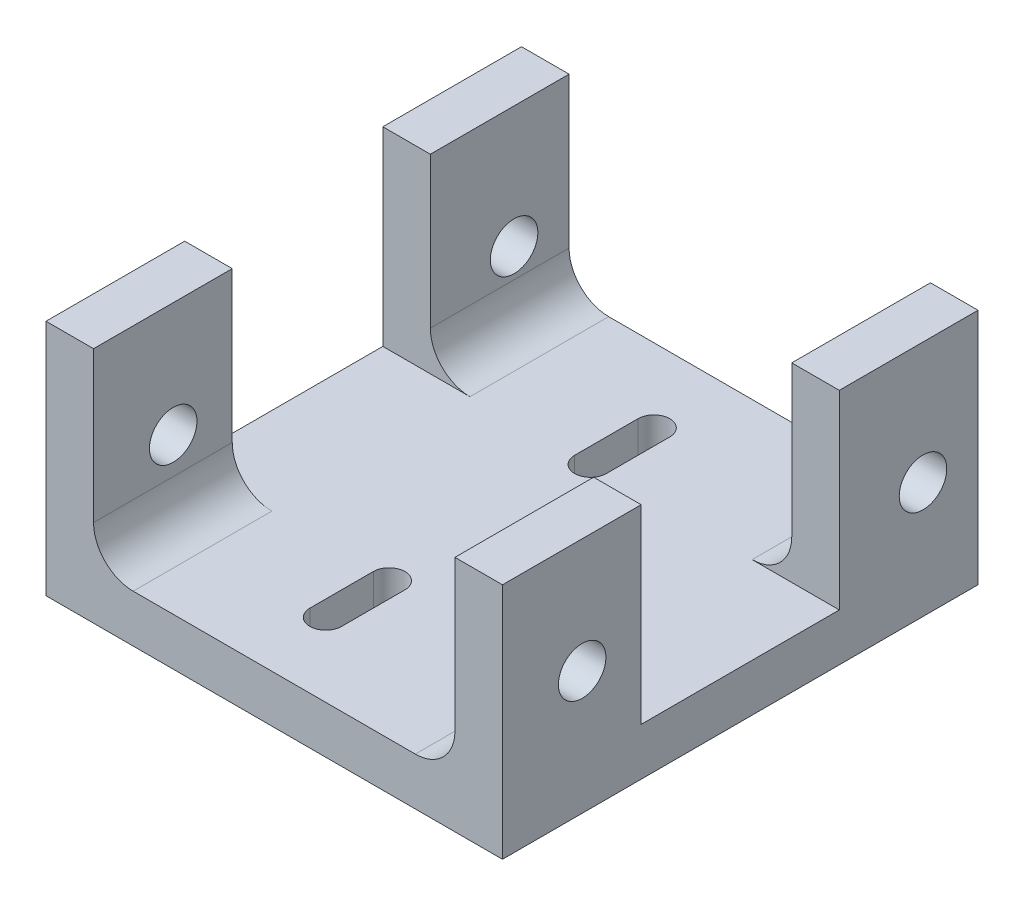
ISO-10303-21;
HEADER;
FILE_DESCRIPTION(('STEP AP214'),'2;1');
FILE_NAME('part.step','',(''),(''),'','','');
FILE_SCHEMA(('AUTOMOTIVE_DESIGN { 1 0 10303 214 1 1 1 1 }'));
ENDSEC;
DATA;
#1=APPLICATION_CONTEXT('core data for automotive mechanical design processes');
#2=APPLICATION_PROTOCOL_DEFINITION('international standard','automotive_design',2000,#1);
#3=PRODUCT_CONTEXT('',#1,'mechanical');
#4=PRODUCT('Part','Part','',(#3));
#5=PRODUCT_RELATED_PRODUCT_CATEGORY('part','',(#4));
#6=PRODUCT_DEFINITION_FORMATION('','',#4);
#7=PRODUCT_DEFINITION_CONTEXT('part definition',#1,'design');
#8=PRODUCT_DEFINITION('design','',#6,#7);
#9=PRODUCT_DEFINITION_SHAPE('','',#8);
#10=(LENGTH_UNIT() NAMED_UNIT(*) SI_UNIT(.MILLI.,.METRE.));
#11=(NAMED_UNIT(*) PLANE_ANGLE_UNIT() SI_UNIT($,.RADIAN.));
#12=(NAMED_UNIT(*) SI_UNIT($,.STERADIAN.) SOLID_ANGLE_UNIT());
#13=UNCERTAINTY_MEASURE_WITH_UNIT(LENGTH_MEASURE(1.E-05),#10,'distance_accuracy_value','');
#14=(GEOMETRIC_REPRESENTATION_CONTEXT(3) GLOBAL_UNCERTAINTY_ASSIGNED_CONTEXT((#13)) GLOBAL_UNIT_ASSIGNED_CONTEXT((#10,
#11,#12)) REPRESENTATION_CONTEXT('',''));
#15=CARTESIAN_POINT('',(0.,0.,0.));
#16=DIRECTION('',(0.,0.,1.));
#17=DIRECTION('',(1.,0.,0.));
#18=AXIS2_PLACEMENT_3D('',#15,#16,#17);
#19=CARTESIAN_POINT('',(0.,0.,30.));
#20=DIRECTION('',(-1.,0.,0.));
#21=DIRECTION('',(0.,0.,1.));
#22=AXIS2_PLACEMENT_3D('',#19,#20,#21);
#23=PLANE('',#22);
#24=CARTESIAN_POINT('',(0.,4.33061865450879,3.46974447810457));
#25=DIRECTION('',(-1.,0.,0.));
#26=DIRECTION('',(0.,0.,1.));
#27=AXIS2_PLACEMENT_3D('',#24,#25,#26);
#28=CIRCLE('',#27,1.49999999999999);
#29=CARTESIAN_POINT('',(0.,4.33061865450879,4.96974447810456));
#30=VERTEX_POINT('',#29);
#31=EDGE_CURVE('E617',#30,#30,#28,.T.);
#32=ORIENTED_EDGE('',*,*,#31,.T.);
#33=EDGE_LOOP('',(#32));
#34=FACE_BOUND('',#33,.T.);
#35=DIRECTION('',(0.,-1.,0.));
#36=VECTOR('',#35,1.);
#37=CARTESIAN_POINT('',(0.,0.,8.75));
#38=LINE('',#37,#36);
#39=CARTESIAN_POINT('',(0.,12.,8.75));
#40=VERTEX_POINT('',#39);
#41=CARTESIAN_POINT('',(0.,2.5,8.75));
#42=VERTEX_POINT('',#41);
#43=EDGE_CURVE('E363',#40,#42,#38,.T.);
#44=ORIENTED_EDGE('',*,*,#43,.T.);
#45=DIRECTION('',(0.,0.,-1.));
#46=VECTOR('',#45,1.);
#47=CARTESIAN_POINT('',(0.,2.5,0.));
#48=LINE('',#47,#46);
#49=CARTESIAN_POINT('',(0.,2.5,0.));
#50=VERTEX_POINT('',#49);
#51=EDGE_CURVE('E486',#42,#50,#48,.T.);
#52=ORIENTED_EDGE('',*,*,#51,.T.);
#53=DIRECTION('',(0.,1.,0.));
#54=VECTOR('',#53,1.);
#55=CARTESIAN_POINT('',(0.,0.,0.));
#56=LINE('',#55,#54);
#57=CARTESIAN_POINT('',(0.,12.,0.));
#58=VERTEX_POINT('',#57);
#59=EDGE_CURVE('E398',#50,#58,#56,.T.);
#60=ORIENTED_EDGE('',*,*,#59,.T.);
#61=DIRECTION('',(0.,0.,-1.));
#62=VECTOR('',#61,1.);
#63=CARTESIAN_POINT('',(0.,12.,30.));
#64=LINE('',#63,#62);
#65=EDGE_CURVE('E444',#40,#58,#64,.T.);
#66=ORIENTED_EDGE('',*,*,#65,.F.);
#67=EDGE_LOOP('',(#44,#52,#60,#66));
#68=FACE_BOUND('',#67,.T.);
#69=ADVANCED_FACE('F39',(#34,#68),#23,.F.);
#70=CARTESIAN_POINT('',(0.,12.,30.));
#71=DIRECTION('',(0.,-1.,0.));
#72=DIRECTION('',(0.,0.,-1.));
#73=AXIS2_PLACEMENT_3D('',#70,#71,#72);
#74=PLANE('',#73);
#75=DIRECTION('',(0.,0.,-1.));
#76=VECTOR('',#75,1.);
#77=CARTESIAN_POINT('',(-3.,12.,30.));
#78=LINE('',#77,#76);
#79=CARTESIAN_POINT('',(-3.,12.,8.75));
#80=VERTEX_POINT('',#79);
#81=CARTESIAN_POINT('',(-3.,12.,0.));
#82=VERTEX_POINT('',#81);
#83=EDGE_CURVE('E439',#80,#82,#78,.T.);
#84=ORIENTED_EDGE('',*,*,#83,.F.);
#85=DIRECTION('',(1.,0.,0.));
#86=VECTOR('',#85,1.);
#87=CARTESIAN_POINT('',(-20.3277234511635,12.,8.75));
#88=LINE('',#87,#86);
#89=EDGE_CURVE('E357',#80,#40,#88,.T.);
#90=ORIENTED_EDGE('',*,*,#89,.T.);
#91=ORIENTED_EDGE('',*,*,#65,.T.);
#92=DIRECTION('',(-1.,0.,0.));
#93=VECTOR('',#92,1.);
#94=CARTESIAN_POINT('',(0.,12.,0.));
#95=LINE('',#94,#93);
#96=EDGE_CURVE('E401',#58,#82,#95,.T.);
#97=ORIENTED_EDGE('',*,*,#96,.T.);
#98=EDGE_LOOP('',(#84,#90,#91,#97));
#99=FACE_BOUND('',#98,.T.);
#100=ADVANCED_FACE('F526',(#99),#74,.F.);
#101=CARTESIAN_POINT('',(25.8,12.,30.));
#102=DIRECTION('',(0.,-1.,0.));
#103=DIRECTION('',(0.,0.,-1.));
#104=AXIS2_PLACEMENT_3D('',#101,#102,#103);
#105=PLANE('',#104);
#106=DIRECTION('',(0.,0.,-1.));
#107=VECTOR('',#106,1.);
#108=CARTESIAN_POINT('',(22.8,12.,30.));
#109=LINE('',#108,#107);
#110=CARTESIAN_POINT('',(22.8,12.,8.75));
#111=VERTEX_POINT('',#110);
#112=CARTESIAN_POINT('',(22.8,12.,0.));
#113=VERTEX_POINT('',#112);
#114=EDGE_CURVE('E394',#111,#113,#109,.T.);
#115=ORIENTED_EDGE('',*,*,#114,.F.);
#116=CARTESIAN_POINT('',(25.8,12.,8.75));
#117=VERTEX_POINT('',#116);
#118=EDGE_CURVE('E344',#111,#117,#88,.T.);
#119=ORIENTED_EDGE('',*,*,#118,.T.);
#120=DIRECTION('',(0.,0.,-1.));
#121=VECTOR('',#120,1.);
#122=CARTESIAN_POINT('',(25.8,12.,30.));
#123=LINE('',#122,#121);
#124=CARTESIAN_POINT('',(25.8,12.,0.));
#125=VERTEX_POINT('',#124);
#126=EDGE_CURVE('E426',#117,#125,#123,.T.);
#127=ORIENTED_EDGE('',*,*,#126,.T.);
#128=DIRECTION('',(-1.,0.,0.));
#129=VECTOR('',#128,1.);
#130=CARTESIAN_POINT('',(25.8,12.,0.));
#131=LINE('',#130,#129);
#132=EDGE_CURVE('E415',#125,#113,#131,.T.);
#133=ORIENTED_EDGE('',*,*,#132,.T.);
#134=EDGE_LOOP('',(#115,#119,#127,#133));
#135=FACE_BOUND('',#134,.T.);
#136=ADVANCED_FACE('F542',(#135),#105,.F.);
#137=CARTESIAN_POINT('',(22.8,12.,30.));
#138=DIRECTION('',(1.,0.,0.));
#139=DIRECTION('',(0.,0.,-1.));
#140=AXIS2_PLACEMENT_3D('',#137,#138,#139);
#141=PLANE('',#140);
#142=CARTESIAN_POINT('',(22.8,4.33061865450879,3.46974447810457));
#143=DIRECTION('',(1.,0.,0.));
#144=DIRECTION('',(0.,0.,-1.));
#145=AXIS2_PLACEMENT_3D('',#142,#143,#144);
#146=CIRCLE('',#145,1.49999999999999);
#147=CARTESIAN_POINT('',(22.8,4.33061865450879,1.96974447810458));
#148=VERTEX_POINT('',#147);
#149=EDGE_CURVE('E621',#148,#148,#146,.T.);
#150=ORIENTED_EDGE('',*,*,#149,.T.);
#151=EDGE_LOOP('',(#150));
#152=FACE_BOUND('',#151,.T.);
#153=DIRECTION('',(0.,-1.,0.));
#154=VECTOR('',#153,1.);
#155=CARTESIAN_POINT('',(22.8,12.,0.));
#156=LINE('',#155,#154);
#157=CARTESIAN_POINT('',(22.8,2.5,0.));
#158=VERTEX_POINT('',#157);
#159=EDGE_CURVE('E372',#113,#158,#156,.T.);
#160=ORIENTED_EDGE('',*,*,#159,.T.);
#161=DIRECTION('',(0.,0.,-1.));
#162=VECTOR('',#161,1.);
#163=CARTESIAN_POINT('',(22.8,2.5,8.75));
#164=LINE('',#163,#162);
#165=CARTESIAN_POINT('',(22.8,2.5,8.75));
#166=VERTEX_POINT('',#165);
#167=EDGE_CURVE('E479',#158,#166,#164,.F.);
#168=ORIENTED_EDGE('',*,*,#167,.T.);
#169=DIRECTION('',(0.,1.,0.));
#170=VECTOR('',#169,1.);
#171=CARTESIAN_POINT('',(22.8,12.,8.75));
#172=LINE('',#171,#170);
#173=EDGE_CURVE('E453',#166,#111,#172,.T.);
#174=ORIENTED_EDGE('',*,*,#173,.T.);
#175=ORIENTED_EDGE('',*,*,#114,.T.);
#176=EDGE_LOOP('',(#160,#168,#174,#175));
#177=FACE_BOUND('',#176,.T.);
#178=ADVANCED_FACE('F557',(#152,#177),#141,.F.);
#179=CARTESIAN_POINT('',(22.8,0.,30.));
#180=DIRECTION('',(0.,-1.,0.));
#181=DIRECTION('',(1.,0.,0.));
#182=AXIS2_PLACEMENT_3D('',#179,#180,#181);
#183=PLANE('',#182);
#184=DIRECTION('',(0.,0.,1.));
#185=VECTOR('',#184,1.);
#186=CARTESIAN_POINT('',(9.,0.,4.6470500908399));
#187=LINE('',#186,#185);
#188=CARTESIAN_POINT('',(9.,0.,4.64705009083991));
#189=VERTEX_POINT('',#188);
#190=CARTESIAN_POINT('',(9.,0.,8.6470500908399));
#191=VERTEX_POINT('',#190);
#192=EDGE_CURVE('E256',#189,#191,#187,.T.);
#193=ORIENTED_EDGE('',*,*,#192,.F.);
#194=CARTESIAN_POINT('',(10.,0.,4.6470500908399));
#195=DIRECTION('',(0.,1.,0.));
#196=DIRECTION('',(-1.,0.,0.));
#197=AXIS2_PLACEMENT_3D('',#194,#195,#196);
#198=CIRCLE('',#197,1.);
#199=CARTESIAN_POINT('',(11.,0.,4.6470500908399));
#200=VERTEX_POINT('',#199);
#201=EDGE_CURVE('E230',#200,#189,#198,.T.);
#202=ORIENTED_EDGE('',*,*,#201,.F.);
#203=DIRECTION('',(0.,0.,-1.));
#204=VECTOR('',#203,1.);
#205=CARTESIAN_POINT('',(11.,0.,4.6470500908399));
#206=LINE('',#205,#204);
#207=CARTESIAN_POINT('',(11.,0.,8.6470500908399));
#208=VERTEX_POINT('',#207);
#209=EDGE_CURVE('E236',#208,#200,#206,.T.);
#210=ORIENTED_EDGE('',*,*,#209,.F.);
#211=CARTESIAN_POINT('',(10.,0.,8.6470500908399));
#212=DIRECTION('',(0.,1.,0.));
#213=DIRECTION('',(-1.,0.,0.));
#214=AXIS2_PLACEMENT_3D('',#211,#212,#213);
#215=CIRCLE('',#214,0.999999999999997);
#216=EDGE_CURVE('E264',#191,#208,#215,.T.);
#217=ORIENTED_EDGE('',*,*,#216,.F.);
#218=EDGE_LOOP('',(#193,#202,#210,#217));
#219=FACE_BOUND('',#218,.T.);
#220=DIRECTION('',(0.,0.,-1.));
#221=VECTOR('',#220,1.);
#222=CARTESIAN_POINT('',(11.,0.,25.3529499091601));
#223=LINE('',#222,#221);
#224=CARTESIAN_POINT('',(11.,0.,25.3529499091601));
#225=VERTEX_POINT('',#224);
#226=CARTESIAN_POINT('',(11.,0.,21.3529499091601));
#227=VERTEX_POINT('',#226);
#228=EDGE_CURVE('E293',#225,#227,#223,.T.);
#229=ORIENTED_EDGE('',*,*,#228,.F.);
#230=CARTESIAN_POINT('',(10.,0.,25.3529499091601));
#231=DIRECTION('',(0.,1.,0.));
#232=DIRECTION('',(1.,0.,0.));
#233=AXIS2_PLACEMENT_3D('',#230,#231,#232);
#234=CIRCLE('',#233,1.);
#235=CARTESIAN_POINT('',(9.,0.,25.3529499091601));
#236=VERTEX_POINT('',#235);
#237=EDGE_CURVE('E290',#236,#225,#234,.T.);
#238=ORIENTED_EDGE('',*,*,#237,.F.);
#239=DIRECTION('',(0.,0.,1.));
#240=VECTOR('',#239,1.);
#241=CARTESIAN_POINT('',(9.,0.,25.3529499091601));
#242=LINE('',#241,#240);
#243=CARTESIAN_POINT('',(9.,0.,21.3529499091601));
#244=VERTEX_POINT('',#243);
#245=EDGE_CURVE('E301',#244,#236,#242,.T.);
#246=ORIENTED_EDGE('',*,*,#245,.F.);
#247=CARTESIAN_POINT('',(10.,0.,21.3529499091601));
#248=DIRECTION('',(0.,1.,0.));
#249=DIRECTION('',(1.,0.,0.));
#250=AXIS2_PLACEMENT_3D('',#247,#248,#249);
#251=CIRCLE('',#250,0.999999999999997);
#252=EDGE_CURVE('E297',#227,#244,#251,.T.);
#253=ORIENTED_EDGE('',*,*,#252,.F.);
#254=EDGE_LOOP('',(#229,#238,#246,#253));
#255=FACE_BOUND('',#254,.T.);
#256=DIRECTION('',(-1.,0.,0.));
#257=VECTOR('',#256,1.);
#258=CARTESIAN_POINT('',(22.8,0.,30.));
#259=LINE('',#258,#257);
#260=CARTESIAN_POINT('',(20.3,0.,30.));
#261=VERTEX_POINT('',#260);
#262=CARTESIAN_POINT('',(2.5,0.,30.));
#263=VERTEX_POINT('',#262);
#264=EDGE_CURVE('E367',#261,#263,#259,.T.);
#265=ORIENTED_EDGE('',*,*,#264,.F.);
#266=DIRECTION('',(0.,0.,-1.));
#267=VECTOR('',#266,1.);
#268=CARTESIAN_POINT('',(20.3,0.,21.25));
#269=LINE('',#268,#267);
#270=CARTESIAN_POINT('',(20.3,0.,21.25));
#271=VERTEX_POINT('',#270);
#272=EDGE_CURVE('E472',#261,#271,#269,.T.);
#273=ORIENTED_EDGE('',*,*,#272,.T.);
#274=DIRECTION('',(1.,0.,0.));
#275=VECTOR('',#274,1.);
#276=CARTESIAN_POINT('',(-20.3277234511635,0.,21.25));
#277=LINE('',#276,#275);
#278=CARTESIAN_POINT('',(25.8,0.,21.25));
#279=VERTEX_POINT('',#278);
#280=EDGE_CURVE('E351',#271,#279,#277,.T.);
#281=ORIENTED_EDGE('',*,*,#280,.T.);
#282=DIRECTION('',(0.,0.,-1.));
#283=VECTOR('',#282,1.);
#284=CARTESIAN_POINT('',(25.8,0.,21.25));
#285=LINE('',#284,#283);
#286=CARTESIAN_POINT('',(25.8,0.,8.75));
#287=VERTEX_POINT('',#286);
#288=EDGE_CURVE('E340',#279,#287,#285,.T.);
#289=ORIENTED_EDGE('',*,*,#288,.T.);
#290=DIRECTION('',(1.,0.,0.));
#291=VECTOR('',#290,1.);
#292=CARTESIAN_POINT('',(-20.3277234511635,0.,8.75));
#293=LINE('',#292,#291);
#294=CARTESIAN_POINT('',(20.3,0.,8.75));
#295=VERTEX_POINT('',#294);
#296=EDGE_CURVE('E347',#295,#287,#293,.T.);
#297=ORIENTED_EDGE('',*,*,#296,.F.);
#298=DIRECTION('',(0.,0.,-1.));
#299=VECTOR('',#298,1.);
#300=CARTESIAN_POINT('',(20.3,0.,0.));
#301=LINE('',#300,#299);
#302=CARTESIAN_POINT('',(20.3,0.,0.));
#303=VERTEX_POINT('',#302);
#304=EDGE_CURVE('E468',#295,#303,#301,.T.);
#305=ORIENTED_EDGE('',*,*,#304,.T.);
#306=DIRECTION('',(-1.,0.,0.));
#307=VECTOR('',#306,1.);
#308=CARTESIAN_POINT('',(22.8,0.,0.));
#309=LINE('',#308,#307);
#310=CARTESIAN_POINT('',(2.5,0.,0.));
#311=VERTEX_POINT('',#310);
#312=EDGE_CURVE('E366',#303,#311,#309,.T.);
#313=ORIENTED_EDGE('',*,*,#312,.T.);
#314=DIRECTION('',(0.,0.,-1.));
#315=VECTOR('',#314,1.);
#316=CARTESIAN_POINT('',(2.5,0.,8.75));
#317=LINE('',#316,#315);
#318=CARTESIAN_POINT('',(2.5,0.,8.75));
#319=VERTEX_POINT('',#318);
#320=EDGE_CURVE('E456',#311,#319,#317,.F.);
#321=ORIENTED_EDGE('',*,*,#320,.T.);
#322=CARTESIAN_POINT('',(-3.,0.,8.75));
#323=VERTEX_POINT('',#322);
#324=EDGE_CURVE('E326',#323,#319,#293,.T.);
#325=ORIENTED_EDGE('',*,*,#324,.F.);
#326=DIRECTION('',(0.,0.,1.));
#327=VECTOR('',#326,1.);
#328=CARTESIAN_POINT('',(-3.,0.,21.25));
#329=LINE('',#328,#327);
#330=CARTESIAN_POINT('',(-3.,0.,21.25));
#331=VERTEX_POINT('',#330);
#332=EDGE_CURVE('E325',#323,#331,#329,.T.);
#333=ORIENTED_EDGE('',*,*,#332,.T.);
#334=CARTESIAN_POINT('',(2.5,0.,21.25));
#335=VERTEX_POINT('',#334);
#336=EDGE_CURVE('E348',#331,#335,#277,.T.);
#337=ORIENTED_EDGE('',*,*,#336,.T.);
#338=DIRECTION('',(0.,0.,-1.));
#339=VECTOR('',#338,1.);
#340=CARTESIAN_POINT('',(2.5,0.,30.));
#341=LINE('',#340,#339);
#342=EDGE_CURVE('E465',#335,#263,#341,.F.);
#343=ORIENTED_EDGE('',*,*,#342,.T.);
#344=EDGE_LOOP('',(#265,#273,#281,#289,#297,#305,#313,#321,#325,#333,#337,#343));
#345=FACE_BOUND('',#344,.T.);
#346=ADVANCED_FACE('F516',(#219,#255,#345),#183,.F.);
#347=CARTESIAN_POINT('',(0.,4.78162916549157,24.9741197219324));
#348=DIRECTION('',(-1.,0.,0.));
#349=DIRECTION('',(0.,0.,1.));
#350=AXIS2_PLACEMENT_3D('',#347,#348,#349);
#351=CIRCLE('',#350,1.49999999999999);
#352=CARTESIAN_POINT('',(0.,4.78162916549157,26.4741197219324));
#353=VERTEX_POINT('',#352);
#354=EDGE_CURVE('E282',#353,#353,#351,.T.);
#355=ORIENTED_EDGE('',*,*,#354,.T.);
#356=EDGE_LOOP('',(#355));
#357=FACE_BOUND('',#356,.T.);
#358=DIRECTION('',(0.,1.,0.));
#359=VECTOR('',#358,1.);
#360=CARTESIAN_POINT('',(0.,0.,30.));
#361=LINE('',#360,#359);
#362=CARTESIAN_POINT('',(0.,2.5,30.));
#363=VERTEX_POINT('',#362);
#364=CARTESIAN_POINT('',(0.,12.,30.));
#365=VERTEX_POINT('',#364);
#366=EDGE_CURVE('E371',#363,#365,#361,.T.);
#367=ORIENTED_EDGE('',*,*,#366,.F.);
#368=DIRECTION('',(0.,0.,-1.));
#369=VECTOR('',#368,1.);
#370=CARTESIAN_POINT('',(0.,2.5,21.25));
#371=LINE('',#370,#369);
#372=CARTESIAN_POINT('',(0.,2.5,21.25));
#373=VERTEX_POINT('',#372);
#374=EDGE_CURVE('E482',#363,#373,#371,.T.);
#375=ORIENTED_EDGE('',*,*,#374,.T.);
#376=DIRECTION('',(0.,1.,0.));
#377=VECTOR('',#376,1.);
#378=CARTESIAN_POINT('',(0.,0.,21.25));
#379=LINE('',#378,#377);
#380=CARTESIAN_POINT('',(0.,12.,21.25));
#381=VERTEX_POINT('',#380);
#382=EDGE_CURVE('E333',#373,#381,#379,.T.);
#383=ORIENTED_EDGE('',*,*,#382,.T.);
#384=EDGE_CURVE('E445',#365,#381,#64,.T.);
#385=ORIENTED_EDGE('',*,*,#384,.F.);
#386=EDGE_LOOP('',(#367,#375,#383,#385));
#387=FACE_BOUND('',#386,.T.);
#388=ADVANCED_FACE('F598',(#357,#387),#23,.F.);
#389=ORIENTED_EDGE('',*,*,#384,.T.);
#390=DIRECTION('',(1.,0.,0.));
#391=VECTOR('',#390,1.);
#392=CARTESIAN_POINT('',(-20.3277234511635,12.,21.25));
#393=LINE('',#392,#391);
#394=CARTESIAN_POINT('',(-3.,12.,21.25));
#395=VERTEX_POINT('',#394);
#396=EDGE_CURVE('E352',#395,#381,#393,.T.);
#397=ORIENTED_EDGE('',*,*,#396,.F.);
#398=CARTESIAN_POINT('',(-3.,12.,30.));
#399=VERTEX_POINT('',#398);
#400=EDGE_CURVE('E440',#399,#395,#78,.T.);
#401=ORIENTED_EDGE('',*,*,#400,.F.);
#402=DIRECTION('',(-1.,0.,0.));
#403=VECTOR('',#402,1.);
#404=CARTESIAN_POINT('',(0.,12.,30.));
#405=LINE('',#404,#403);
#406=EDGE_CURVE('E375',#365,#399,#405,.T.);
#407=ORIENTED_EDGE('',*,*,#406,.F.);
#408=EDGE_LOOP('',(#389,#397,#401,#407));
#409=FACE_BOUND('',#408,.T.);
#410=ADVANCED_FACE('F585',(#409),#74,.F.);
#411=CARTESIAN_POINT('',(-3.,12.,30.));
#412=DIRECTION('',(1.,0.,0.));
#413=DIRECTION('',(0.,0.,-1.));
#414=AXIS2_PLACEMENT_3D('',#411,#412,#413);
#415=PLANE('',#414);
#416=CARTESIAN_POINT('',(-3.00000000000001,4.33061865450879,3.46974447810457));
#417=DIRECTION('',(-1.,0.,0.));
#418=DIRECTION('',(0.,0.,1.));
#419=AXIS2_PLACEMENT_3D('',#416,#417,#418);
#420=CIRCLE('',#419,1.49999999999999);
#421=CARTESIAN_POINT('',(-3.00000000000001,4.33061865450879,4.96974447810456));
#422=VERTEX_POINT('',#421);
#423=EDGE_CURVE('E722',#422,#422,#420,.T.);
#424=ORIENTED_EDGE('',*,*,#423,.F.);
#425=EDGE_LOOP('',(#424));
#426=FACE_BOUND('',#425,.T.);
#427=CARTESIAN_POINT('',(-3.00000000000001,4.78162916549157,24.9741197219324));
#428=DIRECTION('',(-1.,0.,0.));
#429=DIRECTION('',(0.,0.,1.));
#430=AXIS2_PLACEMENT_3D('',#427,#428,#429);
#431=CIRCLE('',#430,1.49999999999999);
#432=CARTESIAN_POINT('',(-3.00000000000001,4.78162916549157,26.4741197219324));
#433=VERTEX_POINT('',#432);
#434=EDGE_CURVE('E620',#433,#433,#431,.T.);
#435=ORIENTED_EDGE('',*,*,#434,.F.);
#436=EDGE_LOOP('',(#435));
#437=FACE_BOUND('',#436,.T.);
#438=ORIENTED_EDGE('',*,*,#332,.F.);
#439=DIRECTION('',(0.,-1.,0.));
#440=VECTOR('',#439,1.);
#441=CARTESIAN_POINT('',(-3.,12.,8.75));
#442=LINE('',#441,#440);
#443=EDGE_CURVE('E330',#80,#323,#442,.T.);
#444=ORIENTED_EDGE('',*,*,#443,.F.);
#445=ORIENTED_EDGE('',*,*,#83,.T.);
#446=DIRECTION('',(0.,-1.,0.));
#447=VECTOR('',#446,1.);
#448=CARTESIAN_POINT('',(-3.,12.,0.));
#449=LINE('',#448,#447);
#450=CARTESIAN_POINT('',(-3.,-3.,0.));
#451=VERTEX_POINT('',#450);
#452=EDGE_CURVE('E405',#82,#451,#449,.T.);
#453=ORIENTED_EDGE('',*,*,#452,.T.);
#454=DIRECTION('',(0.,0.,-1.));
#455=VECTOR('',#454,1.);
#456=CARTESIAN_POINT('',(-3.,-3.,30.));
#457=LINE('',#456,#455);
#458=CARTESIAN_POINT('',(-3.,-3.,30.));
#459=VERTEX_POINT('',#458);
#460=EDGE_CURVE('E435',#459,#451,#457,.T.);
#461=ORIENTED_EDGE('',*,*,#460,.F.);
#462=DIRECTION('',(0.,-1.,0.));
#463=VECTOR('',#462,1.);
#464=CARTESIAN_POINT('',(-3.,12.,30.));
#465=LINE('',#464,#463);
#466=EDGE_CURVE('E378',#399,#459,#465,.T.);
#467=ORIENTED_EDGE('',*,*,#466,.F.);
#468=ORIENTED_EDGE('',*,*,#400,.T.);
#469=DIRECTION('',(0.,1.,0.));
#470=VECTOR('',#469,1.);
#471=CARTESIAN_POINT('',(-3.,12.,21.25));
#472=LINE('',#471,#470);
#473=EDGE_CURVE('E322',#331,#395,#472,.T.);
#474=ORIENTED_EDGE('',*,*,#473,.F.);
#475=EDGE_LOOP('',(#438,#444,#445,#453,#461,#467,#468,#474));
#476=FACE_BOUND('',#475,.T.);
#477=ADVANCED_FACE('F579',(#426,#437,#476),#415,.F.);
#478=CARTESIAN_POINT('',(-3.,-3.,30.));
#479=DIRECTION('',(0.,1.,0.));
#480=DIRECTION('',(-1.,0.,0.));
#481=AXIS2_PLACEMENT_3D('',#478,#479,#480);
#482=PLANE('',#481);
#483=DIRECTION('',(0.,0.,1.));
#484=VECTOR('',#483,1.);
#485=CARTESIAN_POINT('',(11.,-3.,4.6470500908399));
#486=LINE('',#485,#484);
#487=CARTESIAN_POINT('',(11.,-3.,4.6470500908399));
#488=VERTEX_POINT('',#487);
#489=CARTESIAN_POINT('',(11.,-3.,8.6470500908399));
#490=VERTEX_POINT('',#489);
#491=EDGE_CURVE('E251',#488,#490,#486,.T.);
#492=ORIENTED_EDGE('',*,*,#491,.F.);
#493=CARTESIAN_POINT('',(10.,-3.,4.6470500908399));
#494=DIRECTION('',(0.,1.,0.));
#495=DIRECTION('',(-1.,0.,0.));
#496=AXIS2_PLACEMENT_3D('',#493,#494,#495);
#497=CIRCLE('',#496,1.);
#498=CARTESIAN_POINT('',(9.,-3.,4.6470500908399));
#499=VERTEX_POINT('',#498);
#500=EDGE_CURVE('E227',#499,#488,#497,.F.);
#501=ORIENTED_EDGE('',*,*,#500,.F.);
#502=DIRECTION('',(0.,0.,-1.));
#503=VECTOR('',#502,1.);
#504=CARTESIAN_POINT('',(9.,-3.,4.6470500908399));
#505=LINE('',#504,#503);
#506=CARTESIAN_POINT('',(9.,-3.,8.6470500908399));
#507=VERTEX_POINT('',#506);
#508=EDGE_CURVE('E240',#507,#499,#505,.T.);
#509=ORIENTED_EDGE('',*,*,#508,.F.);
#510=CARTESIAN_POINT('',(10.,-3.,8.6470500908399));
#511=DIRECTION('',(0.,1.,0.));
#512=DIRECTION('',(-1.,0.,0.));
#513=AXIS2_PLACEMENT_3D('',#510,#511,#512);
#514=CIRCLE('',#513,0.999999999999997);
#515=EDGE_CURVE('E258',#490,#507,#514,.F.);
#516=ORIENTED_EDGE('',*,*,#515,.F.);
#517=EDGE_LOOP('',(#492,#501,#509,#516));
#518=FACE_BOUND('',#517,.T.);
#519=DIRECTION('',(0.,0.,-1.));
#520=VECTOR('',#519,1.);
#521=CARTESIAN_POINT('',(9.,-3.,25.3529499091601));
#522=LINE('',#521,#520);
#523=CARTESIAN_POINT('',(9.,-3.,25.3529499091601));
#524=VERTEX_POINT('',#523);
#525=CARTESIAN_POINT('',(9.,-3.,21.3529499091601));
#526=VERTEX_POINT('',#525);
#527=EDGE_CURVE('E281',#524,#526,#522,.T.);
#528=ORIENTED_EDGE('',*,*,#527,.F.);
#529=CARTESIAN_POINT('',(10.,-3.,25.3529499091601));
#530=DIRECTION('',(0.,1.,0.));
#531=DIRECTION('',(-1.,0.,0.));
#532=AXIS2_PLACEMENT_3D('',#529,#530,#531);
#533=CIRCLE('',#532,1.);
#534=CARTESIAN_POINT('',(11.,-3.,25.3529499091601));
#535=VERTEX_POINT('',#534);
#536=EDGE_CURVE('E286',#535,#524,#533,.F.);
#537=ORIENTED_EDGE('',*,*,#536,.F.);
#538=DIRECTION('',(0.,0.,1.));
#539=VECTOR('',#538,1.);
#540=CARTESIAN_POINT('',(11.,-3.,25.3529499091601));
#541=LINE('',#540,#539);
#542=CARTESIAN_POINT('',(11.,-3.,21.3529499091601));
#543=VERTEX_POINT('',#542);
#544=EDGE_CURVE('E309',#543,#535,#541,.T.);
#545=ORIENTED_EDGE('',*,*,#544,.F.);
#546=CARTESIAN_POINT('',(10.,-3.,21.3529499091601));
#547=DIRECTION('',(0.,1.,0.));
#548=DIRECTION('',(-1.,0.,0.));
#549=AXIS2_PLACEMENT_3D('',#546,#547,#548);
#550=CIRCLE('',#549,0.999999999999997);
#551=EDGE_CURVE('E278',#526,#543,#550,.F.);
#552=ORIENTED_EDGE('',*,*,#551,.F.);
#553=EDGE_LOOP('',(#528,#537,#545,#552));
#554=FACE_BOUND('',#553,.T.);
#555=DIRECTION('',(1.,0.,0.));
#556=VECTOR('',#555,1.);
#557=CARTESIAN_POINT('',(-3.,-3.,0.));
#558=LINE('',#557,#556);
#559=CARTESIAN_POINT('',(25.8,-3.,0.));
#560=VERTEX_POINT('',#559);
#561=EDGE_CURVE('E408',#451,#560,#558,.T.);
#562=ORIENTED_EDGE('',*,*,#561,.T.);
#563=DIRECTION('',(0.,0.,-1.));
#564=VECTOR('',#563,1.);
#565=CARTESIAN_POINT('',(25.8,-3.,30.));
#566=LINE('',#565,#564);
#567=CARTESIAN_POINT('',(25.8,-3.,30.));
#568=VERTEX_POINT('',#567);
#569=EDGE_CURVE('E431',#568,#560,#566,.T.);
#570=ORIENTED_EDGE('',*,*,#569,.F.);
#571=DIRECTION('',(1.,0.,0.));
#572=VECTOR('',#571,1.);
#573=CARTESIAN_POINT('',(-3.,-3.,30.));
#574=LINE('',#573,#572);
#575=EDGE_CURVE('E381',#459,#568,#574,.T.);
#576=ORIENTED_EDGE('',*,*,#575,.F.);
#577=ORIENTED_EDGE('',*,*,#460,.T.);
#578=EDGE_LOOP('',(#562,#570,#576,#577));
#579=FACE_BOUND('',#578,.T.);
#580=ADVANCED_FACE('F248',(#518,#554,#579),#482,.F.);
#581=CARTESIAN_POINT('',(25.8,-3.,30.));
#582=DIRECTION('',(-1.,0.,0.));
#583=DIRECTION('',(0.,0.,1.));
#584=AXIS2_PLACEMENT_3D('',#581,#582,#583);
#585=PLANE('',#584);
#586=CARTESIAN_POINT('',(25.8,4.33061865450879,3.46974447810457));
#587=DIRECTION('',(-1.,0.,0.));
#588=DIRECTION('',(0.,0.,1.));
#589=AXIS2_PLACEMENT_3D('',#586,#587,#588);
#590=CIRCLE('',#589,1.49999999999998);
#591=CARTESIAN_POINT('',(25.8,4.33061865450879,4.96974447810455));
#592=VERTEX_POINT('',#591);
#593=EDGE_CURVE('E628',#592,#592,#590,.T.);
#594=ORIENTED_EDGE('',*,*,#593,.T.);
#595=EDGE_LOOP('',(#594));
#596=FACE_BOUND('',#595,.T.);
#597=CARTESIAN_POINT('',(25.8,4.78162916549157,24.9741197219324));
#598=DIRECTION('',(-1.,0.,0.));
#599=DIRECTION('',(0.,0.,1.));
#600=AXIS2_PLACEMENT_3D('',#597,#598,#599);
#601=CIRCLE('',#600,1.49999999999998);
#602=CARTESIAN_POINT('',(25.8,4.78162916549157,26.4741197219324));
#603=VERTEX_POINT('',#602);
#604=EDGE_CURVE('E461',#603,#603,#601,.T.);
#605=ORIENTED_EDGE('',*,*,#604,.T.);
#606=EDGE_LOOP('',(#605));
#607=FACE_BOUND('',#606,.T.);
#608=ORIENTED_EDGE('',*,*,#126,.F.);
#609=DIRECTION('',(0.,1.,0.));
#610=VECTOR('',#609,1.);
#611=CARTESIAN_POINT('',(25.8,12.,8.75));
#612=LINE('',#611,#610);
#613=EDGE_CURVE('E245',#287,#117,#612,.T.);
#614=ORIENTED_EDGE('',*,*,#613,.F.);
#615=ORIENTED_EDGE('',*,*,#288,.F.);
#616=DIRECTION('',(0.,-1.,0.));
#617=VECTOR('',#616,1.);
#618=CARTESIAN_POINT('',(25.8,12.,21.25));
#619=LINE('',#618,#617);
#620=CARTESIAN_POINT('',(25.8,12.,21.25));
#621=VERTEX_POINT('',#620);
#622=EDGE_CURVE('E336',#621,#279,#619,.T.);
#623=ORIENTED_EDGE('',*,*,#622,.F.);
#624=CARTESIAN_POINT('',(25.8,12.,30.));
#625=VERTEX_POINT('',#624);
#626=EDGE_CURVE('E427',#625,#621,#123,.T.);
#627=ORIENTED_EDGE('',*,*,#626,.F.);
#628=DIRECTION('',(0.,1.,0.));
#629=VECTOR('',#628,1.);
#630=CARTESIAN_POINT('',(25.8,-3.,30.));
#631=LINE('',#630,#629);
#632=EDGE_CURVE('E384',#568,#625,#631,.T.);
#633=ORIENTED_EDGE('',*,*,#632,.F.);
#634=ORIENTED_EDGE('',*,*,#569,.T.);
#635=DIRECTION('',(0.,1.,0.));
#636=VECTOR('',#635,1.);
#637=CARTESIAN_POINT('',(25.8,-3.,0.));
#638=LINE('',#637,#636);
#639=EDGE_CURVE('E411',#560,#125,#638,.T.);
#640=ORIENTED_EDGE('',*,*,#639,.T.);
#641=EDGE_LOOP('',(#608,#614,#615,#623,#627,#633,#634,#640));
#642=FACE_BOUND('',#641,.T.);
#643=ADVANCED_FACE('F547',(#596,#607,#642),#585,.F.);
#644=ORIENTED_EDGE('',*,*,#626,.T.);
#645=CARTESIAN_POINT('',(22.8,12.,21.25));
#646=VERTEX_POINT('',#645);
#647=EDGE_CURVE('E356',#646,#621,#393,.T.);
#648=ORIENTED_EDGE('',*,*,#647,.F.);
#649=CARTESIAN_POINT('',(22.8,12.,30.));
#650=VERTEX_POINT('',#649);
#651=EDGE_CURVE('E422',#650,#646,#109,.T.);
#652=ORIENTED_EDGE('',*,*,#651,.F.);
#653=DIRECTION('',(-1.,0.,0.));
#654=VECTOR('',#653,1.);
#655=CARTESIAN_POINT('',(25.8,12.,30.));
#656=LINE('',#655,#654);
#657=EDGE_CURVE('E387',#625,#650,#656,.T.);
#658=ORIENTED_EDGE('',*,*,#657,.F.);
#659=EDGE_LOOP('',(#644,#648,#652,#658));
#660=FACE_BOUND('',#659,.T.);
#661=ADVANCED_FACE('F568',(#660),#105,.F.);
#662=CARTESIAN_POINT('',(22.8,4.78162916549157,24.9741197219324));
#663=DIRECTION('',(1.,0.,0.));
#664=DIRECTION('',(0.,0.,-1.));
#665=AXIS2_PLACEMENT_3D('',#662,#663,#664);
#666=CIRCLE('',#665,1.49999999999999);
#667=CARTESIAN_POINT('',(22.8,4.78162916549157,23.4741197219324));
#668=VERTEX_POINT('',#667);
#669=EDGE_CURVE('E457',#668,#668,#666,.T.);
#670=ORIENTED_EDGE('',*,*,#669,.T.);
#671=EDGE_LOOP('',(#670));
#672=FACE_BOUND('',#671,.T.);
#673=DIRECTION('',(0.,-1.,0.));
#674=VECTOR('',#673,1.);
#675=CARTESIAN_POINT('',(22.8,12.,21.25));
#676=LINE('',#675,#674);
#677=CARTESIAN_POINT('',(22.8,2.5,21.25));
#678=VERTEX_POINT('',#677);
#679=EDGE_CURVE('E449',#646,#678,#676,.T.);
#680=ORIENTED_EDGE('',*,*,#679,.T.);
#681=DIRECTION('',(0.,0.,-1.));
#682=VECTOR('',#681,1.);
#683=CARTESIAN_POINT('',(22.8,2.5,30.));
#684=LINE('',#683,#682);
#685=CARTESIAN_POINT('',(22.8,2.5,30.));
#686=VERTEX_POINT('',#685);
#687=EDGE_CURVE('E476',#678,#686,#684,.F.);
#688=ORIENTED_EDGE('',*,*,#687,.T.);
#689=DIRECTION('',(0.,-1.,0.));
#690=VECTOR('',#689,1.);
#691=CARTESIAN_POINT('',(22.8,12.,30.));
#692=LINE('',#691,#690);
#693=EDGE_CURVE('E390',#650,#686,#692,.T.);
#694=ORIENTED_EDGE('',*,*,#693,.F.);
#695=ORIENTED_EDGE('',*,*,#651,.T.);
#696=EDGE_LOOP('',(#680,#688,#694,#695));
#697=FACE_BOUND('',#696,.T.);
#698=ADVANCED_FACE('F674',(#672,#697),#141,.F.);
#699=CARTESIAN_POINT('',(0.,0.,30.));
#700=DIRECTION('',(0.,0.,-1.));
#701=DIRECTION('',(-1.,0.,0.));
#702=AXIS2_PLACEMENT_3D('',#699,#700,#701);
#703=PLANE('',#702);
#704=ORIENTED_EDGE('',*,*,#693,.T.);
#705=CARTESIAN_POINT('',(20.3,2.5,30.));
#706=DIRECTION('',(0.,0.,-1.));
#707=DIRECTION('',(-1.,0.,0.));
#708=AXIS2_PLACEMENT_3D('',#705,#706,#707);
#709=CIRCLE('',#708,2.5);
#710=EDGE_CURVE('E492',#686,#261,#709,.T.);
#711=ORIENTED_EDGE('',*,*,#710,.T.);
#712=ORIENTED_EDGE('',*,*,#264,.T.);
#713=CARTESIAN_POINT('',(2.5,2.5,30.));
#714=DIRECTION('',(0.,0.,-1.));
#715=DIRECTION('',(-1.,0.,0.));
#716=AXIS2_PLACEMENT_3D('',#713,#714,#715);
#717=CIRCLE('',#716,2.5);
#718=EDGE_CURVE('E506',#263,#363,#717,.T.);
#719=ORIENTED_EDGE('',*,*,#718,.T.);
#720=ORIENTED_EDGE('',*,*,#366,.T.);
#721=ORIENTED_EDGE('',*,*,#406,.T.);
#722=ORIENTED_EDGE('',*,*,#466,.T.);
#723=ORIENTED_EDGE('',*,*,#575,.T.);
#724=ORIENTED_EDGE('',*,*,#632,.T.);
#725=ORIENTED_EDGE('',*,*,#657,.T.);
#726=EDGE_LOOP('',(#704,#711,#712,#719,#720,#721,#722,#723,#724,#725));
#727=FACE_BOUND('',#726,.T.);
#728=ADVANCED_FACE('F572',(#727),#703,.F.);
#729=CARTESIAN_POINT('',(0.,0.,0.));
#730=DIRECTION('',(0.,0.,-1.));
#731=DIRECTION('',(-1.,0.,0.));
#732=AXIS2_PLACEMENT_3D('',#729,#730,#731);
#733=PLANE('',#732);
#734=ORIENTED_EDGE('',*,*,#312,.F.);
#735=CARTESIAN_POINT('',(20.3,2.5,0.));
#736=DIRECTION('',(0.,0.,-1.));
#737=DIRECTION('',(-1.,0.,0.));
#738=AXIS2_PLACEMENT_3D('',#735,#736,#737);
#739=CIRCLE('',#738,2.5);
#740=EDGE_CURVE('E495',#303,#158,#739,.F.);
#741=ORIENTED_EDGE('',*,*,#740,.T.);
#742=ORIENTED_EDGE('',*,*,#159,.F.);
#743=ORIENTED_EDGE('',*,*,#132,.F.);
#744=ORIENTED_EDGE('',*,*,#639,.F.);
#745=ORIENTED_EDGE('',*,*,#561,.F.);
#746=ORIENTED_EDGE('',*,*,#452,.F.);
#747=ORIENTED_EDGE('',*,*,#96,.F.);
#748=ORIENTED_EDGE('',*,*,#59,.F.);
#749=CARTESIAN_POINT('',(2.5,2.5,0.));
#750=DIRECTION('',(0.,0.,-1.));
#751=DIRECTION('',(-1.,0.,0.));
#752=AXIS2_PLACEMENT_3D('',#749,#750,#751);
#753=CIRCLE('',#752,2.5);
#754=EDGE_CURVE('E48',#50,#311,#753,.F.);
#755=ORIENTED_EDGE('',*,*,#754,.T.);
#756=EDGE_LOOP('',(#734,#741,#742,#743,#744,#745,#746,#747,#748,#755));
#757=FACE_BOUND('',#756,.T.);
#758=ADVANCED_FACE('F512',(#757),#733,.T.);
#759=CARTESIAN_POINT('',(-20.3277234511635,12.,21.25));
#760=DIRECTION('',(0.,0.,1.));
#761=DIRECTION('',(1.,0.,0.));
#762=AXIS2_PLACEMENT_3D('',#759,#760,#761);
#763=PLANE('',#762);
#764=ORIENTED_EDGE('',*,*,#647,.T.);
#765=ORIENTED_EDGE('',*,*,#622,.T.);
#766=ORIENTED_EDGE('',*,*,#280,.F.);
#767=CARTESIAN_POINT('',(20.3,2.5,21.25));
#768=DIRECTION('',(0.,0.,1.));
#769=DIRECTION('',(1.,0.,0.));
#770=AXIS2_PLACEMENT_3D('',#767,#768,#769);
#771=CIRCLE('',#770,2.5);
#772=EDGE_CURVE('E489',#271,#678,#771,.T.);
#773=ORIENTED_EDGE('',*,*,#772,.T.);
#774=ORIENTED_EDGE('',*,*,#679,.F.);
#775=EDGE_LOOP('',(#764,#765,#766,#773,#774));
#776=FACE_BOUND('',#775,.T.);
#777=ADVANCED_FACE('F680',(#776),#763,.F.);
#778=CARTESIAN_POINT('',(-20.3277234511635,12.,8.75));
#779=DIRECTION('',(0.,0.,-1.));
#780=DIRECTION('',(0.,1.,0.));
#781=AXIS2_PLACEMENT_3D('',#778,#779,#780);
#782=PLANE('',#781);
#783=ORIENTED_EDGE('',*,*,#296,.T.);
#784=ORIENTED_EDGE('',*,*,#613,.T.);
#785=ORIENTED_EDGE('',*,*,#118,.F.);
#786=ORIENTED_EDGE('',*,*,#173,.F.);
#787=CARTESIAN_POINT('',(20.3,2.5,8.75));
#788=DIRECTION('',(0.,0.,-1.));
#789=DIRECTION('',(0.,1.,0.));
#790=AXIS2_PLACEMENT_3D('',#787,#788,#789);
#791=CIRCLE('',#790,2.5);
#792=EDGE_CURVE('E498',#166,#295,#791,.T.);
#793=ORIENTED_EDGE('',*,*,#792,.T.);
#794=EDGE_LOOP('',(#783,#784,#785,#786,#793));
#795=FACE_BOUND('',#794,.T.);
#796=ADVANCED_FACE('F561',(#795),#782,.F.);
#797=ORIENTED_EDGE('',*,*,#89,.F.);
#798=ORIENTED_EDGE('',*,*,#443,.T.);
#799=ORIENTED_EDGE('',*,*,#324,.T.);
#800=CARTESIAN_POINT('',(2.5,2.5,8.75));
#801=DIRECTION('',(0.,0.,-1.));
#802=DIRECTION('',(0.,1.,0.));
#803=AXIS2_PLACEMENT_3D('',#800,#801,#802);
#804=CIRCLE('',#803,2.5);
#805=EDGE_CURVE('E11',#319,#42,#804,.T.);
#806=ORIENTED_EDGE('',*,*,#805,.T.);
#807=ORIENTED_EDGE('',*,*,#43,.F.);
#808=EDGE_LOOP('',(#797,#798,#799,#806,#807));
#809=FACE_BOUND('',#808,.T.);
#810=ADVANCED_FACE('F522',(#809),#782,.F.);
#811=ORIENTED_EDGE('',*,*,#336,.F.);
#812=ORIENTED_EDGE('',*,*,#473,.T.);
#813=ORIENTED_EDGE('',*,*,#396,.T.);
#814=ORIENTED_EDGE('',*,*,#382,.F.);
#815=CARTESIAN_POINT('',(2.5,2.5,21.25));
#816=DIRECTION('',(0.,0.,1.));
#817=DIRECTION('',(1.,0.,0.));
#818=AXIS2_PLACEMENT_3D('',#815,#816,#817);
#819=CIRCLE('',#818,2.5);
#820=EDGE_CURVE('E502',#373,#335,#819,.T.);
#821=ORIENTED_EDGE('',*,*,#820,.T.);
#822=EDGE_LOOP('',(#811,#812,#813,#814,#821));
#823=FACE_BOUND('',#822,.T.);
#824=ADVANCED_FACE('F589',(#823),#763,.F.);
#825=CARTESIAN_POINT('',(10.,-3.001,25.3529499091601));
#826=DIRECTION('',(0.,1.,0.));
#827=DIRECTION('',(-1.,0.,0.));
#828=AXIS2_PLACEMENT_3D('',#825,#826,#827);
#829=CYLINDRICAL_SURFACE('',#828,1.);
#830=ORIENTED_EDGE('',*,*,#536,.T.);
#831=DIRECTION('',(0.,1.,0.));
#832=VECTOR('',#831,1.);
#833=CARTESIAN_POINT('',(9.,-3.001,25.3529499091601));
#834=LINE('',#833,#832);
#835=EDGE_CURVE('E306',#524,#236,#834,.T.);
#836=ORIENTED_EDGE('',*,*,#835,.T.);
#837=ORIENTED_EDGE('',*,*,#237,.T.);
#838=DIRECTION('',(0.,1.,0.));
#839=VECTOR('',#838,1.);
#840=CARTESIAN_POINT('',(11.,-3.001,25.3529499091601));
#841=LINE('',#840,#839);
#842=EDGE_CURVE('E305',#535,#225,#841,.T.);
#843=ORIENTED_EDGE('',*,*,#842,.F.);
#844=EDGE_LOOP('',(#830,#836,#837,#843));
#845=FACE_BOUND('',#844,.T.);
#846=ADVANCED_FACE('F654',(#845),#829,.F.);
#847=CARTESIAN_POINT('',(9.,-3.001,25.3529499091601));
#848=DIRECTION('',(-1.,0.,0.));
#849=DIRECTION('',(0.,0.,1.));
#850=AXIS2_PLACEMENT_3D('',#847,#848,#849);
#851=PLANE('',#850);
#852=ORIENTED_EDGE('',*,*,#527,.T.);
#853=DIRECTION('',(0.,1.,0.));
#854=VECTOR('',#853,1.);
#855=CARTESIAN_POINT('',(9.,-3.001,21.3529499091601));
#856=LINE('',#855,#854);
#857=EDGE_CURVE('E310',#526,#244,#856,.T.);
#858=ORIENTED_EDGE('',*,*,#857,.T.);
#859=ORIENTED_EDGE('',*,*,#245,.T.);
#860=ORIENTED_EDGE('',*,*,#835,.F.);
#861=EDGE_LOOP('',(#852,#858,#859,#860));
#862=FACE_BOUND('',#861,.T.);
#863=ADVANCED_FACE('F657',(#862),#851,.F.);
#864=CARTESIAN_POINT('',(10.,-3.001,21.3529499091601));
#865=DIRECTION('',(0.,1.,0.));
#866=DIRECTION('',(-1.,0.,0.));
#867=AXIS2_PLACEMENT_3D('',#864,#865,#866);
#868=CYLINDRICAL_SURFACE('',#867,0.999999999999997);
#869=ORIENTED_EDGE('',*,*,#551,.T.);
#870=DIRECTION('',(0.,1.,0.));
#871=VECTOR('',#870,1.);
#872=CARTESIAN_POINT('',(11.,-3.001,21.3529499091601));
#873=LINE('',#872,#871);
#874=EDGE_CURVE('E313',#543,#227,#873,.T.);
#875=ORIENTED_EDGE('',*,*,#874,.T.);
#876=ORIENTED_EDGE('',*,*,#252,.T.);
#877=ORIENTED_EDGE('',*,*,#857,.F.);
#878=EDGE_LOOP('',(#869,#875,#876,#877));
#879=FACE_BOUND('',#878,.T.);
#880=ADVANCED_FACE('F660',(#879),#868,.F.);
#881=CARTESIAN_POINT('',(11.,-3.001,25.3529499091601));
#882=DIRECTION('',(1.,0.,0.));
#883=DIRECTION('',(0.,0.,-1.));
#884=AXIS2_PLACEMENT_3D('',#881,#882,#883);
#885=PLANE('',#884);
#886=ORIENTED_EDGE('',*,*,#544,.T.);
#887=ORIENTED_EDGE('',*,*,#842,.T.);
#888=ORIENTED_EDGE('',*,*,#228,.T.);
#889=ORIENTED_EDGE('',*,*,#874,.F.);
#890=EDGE_LOOP('',(#886,#887,#888,#889));
#891=FACE_BOUND('',#890,.T.);
#892=ADVANCED_FACE('F650',(#891),#885,.F.);
#893=CARTESIAN_POINT('',(10.,-3.001,4.6470500908399));
#894=DIRECTION('',(0.,1.,0.));
#895=DIRECTION('',(-1.,0.,0.));
#896=AXIS2_PLACEMENT_3D('',#893,#894,#895);
#897=CYLINDRICAL_SURFACE('',#896,1.);
#898=ORIENTED_EDGE('',*,*,#500,.T.);
#899=DIRECTION('',(0.,1.,0.));
#900=VECTOR('',#899,1.);
#901=CARTESIAN_POINT('',(11.,-3.001,4.6470500908399));
#902=LINE('',#901,#900);
#903=EDGE_CURVE('E246',#488,#200,#902,.T.);
#904=ORIENTED_EDGE('',*,*,#903,.T.);
#905=ORIENTED_EDGE('',*,*,#201,.T.);
#906=DIRECTION('',(0.,1.,0.));
#907=VECTOR('',#906,1.);
#908=CARTESIAN_POINT('',(9.,-3.001,4.6470500908399));
#909=LINE('',#908,#907);
#910=EDGE_CURVE('E223',#499,#189,#909,.T.);
#911=ORIENTED_EDGE('',*,*,#910,.F.);
#912=EDGE_LOOP('',(#898,#904,#905,#911));
#913=FACE_BOUND('',#912,.T.);
#914=ADVANCED_FACE('F225',(#913),#897,.F.);
#915=CARTESIAN_POINT('',(11.,-3.001,4.6470500908399));
#916=DIRECTION('',(1.,0.,0.));
#917=DIRECTION('',(0.,0.,-1.));
#918=AXIS2_PLACEMENT_3D('',#915,#916,#917);
#919=PLANE('',#918);
#920=ORIENTED_EDGE('',*,*,#491,.T.);
#921=DIRECTION('',(0.,1.,0.));
#922=VECTOR('',#921,1.);
#923=CARTESIAN_POINT('',(11.,-3.001,8.6470500908399));
#924=LINE('',#923,#922);
#925=EDGE_CURVE('E273',#490,#208,#924,.T.);
#926=ORIENTED_EDGE('',*,*,#925,.T.);
#927=ORIENTED_EDGE('',*,*,#209,.T.);
#928=ORIENTED_EDGE('',*,*,#903,.F.);
#929=EDGE_LOOP('',(#920,#926,#927,#928));
#930=FACE_BOUND('',#929,.T.);
#931=ADVANCED_FACE('F642',(#930),#919,.F.);
#932=CARTESIAN_POINT('',(10.,-3.001,8.6470500908399));
#933=DIRECTION('',(0.,1.,0.));
#934=DIRECTION('',(-1.,0.,0.));
#935=AXIS2_PLACEMENT_3D('',#932,#933,#934);
#936=CYLINDRICAL_SURFACE('',#935,0.999999999999997);
#937=ORIENTED_EDGE('',*,*,#515,.T.);
#938=DIRECTION('',(0.,1.,0.));
#939=VECTOR('',#938,1.);
#940=CARTESIAN_POINT('',(9.,-3.001,8.6470500908399));
#941=LINE('',#940,#939);
#942=EDGE_CURVE('E235',#507,#191,#941,.T.);
#943=ORIENTED_EDGE('',*,*,#942,.T.);
#944=ORIENTED_EDGE('',*,*,#216,.T.);
#945=ORIENTED_EDGE('',*,*,#925,.F.);
#946=EDGE_LOOP('',(#937,#943,#944,#945));
#947=FACE_BOUND('',#946,.T.);
#948=ADVANCED_FACE('F638',(#947),#936,.F.);
#949=CARTESIAN_POINT('',(9.,-3.001,4.6470500908399));
#950=DIRECTION('',(-1.,0.,0.));
#951=DIRECTION('',(0.,0.,1.));
#952=AXIS2_PLACEMENT_3D('',#949,#950,#951);
#953=PLANE('',#952);
#954=ORIENTED_EDGE('',*,*,#508,.T.);
#955=ORIENTED_EDGE('',*,*,#910,.T.);
#956=ORIENTED_EDGE('',*,*,#192,.T.);
#957=ORIENTED_EDGE('',*,*,#942,.F.);
#958=EDGE_LOOP('',(#954,#955,#956,#957));
#959=FACE_BOUND('',#958,.T.);
#960=ADVANCED_FACE('F241',(#959),#953,.F.);
#961=CARTESIAN_POINT('',(-3.00000000000001,4.78162916549157,24.9741197219324));
#962=DIRECTION('',(-1.,0.,0.));
#963=DIRECTION('',(0.,0.,1.));
#964=AXIS2_PLACEMENT_3D('',#961,#962,#963);
#965=CYLINDRICAL_SURFACE('',#964,1.49999999999999);
#966=ORIENTED_EDGE('',*,*,#604,.F.);
#967=EDGE_LOOP('',(#966));
#968=FACE_BOUND('',#967,.T.);
#969=ORIENTED_EDGE('',*,*,#669,.F.);
#970=EDGE_LOOP('',(#969));
#971=FACE_BOUND('',#970,.T.);
#972=ADVANCED_FACE('F699',(#968,#971),#965,.F.);
#973=ORIENTED_EDGE('',*,*,#434,.T.);
#974=EDGE_LOOP('',(#973));
#975=FACE_BOUND('',#974,.T.);
#976=ORIENTED_EDGE('',*,*,#354,.F.);
#977=EDGE_LOOP('',(#976));
#978=FACE_BOUND('',#977,.T.);
#979=ADVANCED_FACE('F704',(#975,#978),#965,.F.);
#980=CARTESIAN_POINT('',(-3.00000000000001,4.33061865450879,3.46974447810457));
#981=DIRECTION('',(-1.,0.,0.));
#982=DIRECTION('',(0.,0.,1.));
#983=AXIS2_PLACEMENT_3D('',#980,#981,#982);
#984=CYLINDRICAL_SURFACE('',#983,1.49999999999999);
#985=ORIENTED_EDGE('',*,*,#593,.F.);
#986=EDGE_LOOP('',(#985));
#987=FACE_BOUND('',#986,.T.);
#988=ORIENTED_EDGE('',*,*,#149,.F.);
#989=EDGE_LOOP('',(#988));
#990=FACE_BOUND('',#989,.T.);
#991=ADVANCED_FACE('F707',(#987,#990),#984,.F.);
#992=ORIENTED_EDGE('',*,*,#423,.T.);
#993=EDGE_LOOP('',(#992));
#994=FACE_BOUND('',#993,.T.);
#995=ORIENTED_EDGE('',*,*,#31,.F.);
#996=EDGE_LOOP('',(#995));
#997=FACE_BOUND('',#996,.T.);
#998=ADVANCED_FACE('F709',(#994,#997),#984,.F.);
#999=CARTESIAN_POINT('',(20.3,2.5,30.));
#1000=DIRECTION('',(0.,0.,1.));
#1001=DIRECTION('',(1.,0.,0.));
#1002=AXIS2_PLACEMENT_3D('',#999,#1000,#1001);
#1003=CYLINDRICAL_SURFACE('',#1002,2.5);
#1004=ORIENTED_EDGE('',*,*,#710,.F.);
#1005=ORIENTED_EDGE('',*,*,#687,.F.);
#1006=ORIENTED_EDGE('',*,*,#772,.F.);
#1007=ORIENTED_EDGE('',*,*,#272,.F.);
#1008=EDGE_LOOP('',(#1004,#1005,#1006,#1007));
#1009=FACE_BOUND('',#1008,.T.);
#1010=ADVANCED_FACE('F711',(#1009),#1003,.F.);
#1011=CARTESIAN_POINT('',(20.3,2.5,30.));
#1012=DIRECTION('',(0.,0.,1.));
#1013=DIRECTION('',(1.,0.,0.));
#1014=AXIS2_PLACEMENT_3D('',#1011,#1012,#1013);
#1015=CYLINDRICAL_SURFACE('',#1014,2.5);
#1016=ORIENTED_EDGE('',*,*,#792,.F.);
#1017=ORIENTED_EDGE('',*,*,#167,.F.);
#1018=ORIENTED_EDGE('',*,*,#740,.F.);
#1019=ORIENTED_EDGE('',*,*,#304,.F.);
#1020=EDGE_LOOP('',(#1016,#1017,#1018,#1019));
#1021=FACE_BOUND('',#1020,.T.);
#1022=ADVANCED_FACE('F560',(#1021),#1015,.F.);
#1023=CARTESIAN_POINT('',(2.5,2.5,30.));
#1024=DIRECTION('',(0.,0.,1.));
#1025=DIRECTION('',(1.,0.,0.));
#1026=AXIS2_PLACEMENT_3D('',#1023,#1024,#1025);
#1027=CYLINDRICAL_SURFACE('',#1026,2.5);
#1028=ORIENTED_EDGE('',*,*,#718,.F.);
#1029=ORIENTED_EDGE('',*,*,#342,.F.);
#1030=ORIENTED_EDGE('',*,*,#820,.F.);
#1031=ORIENTED_EDGE('',*,*,#374,.F.);
#1032=EDGE_LOOP('',(#1028,#1029,#1030,#1031));
#1033=FACE_BOUND('',#1032,.T.);
#1034=ADVANCED_FACE('F596',(#1033),#1027,.F.);
#1035=CARTESIAN_POINT('',(2.5,2.5,30.));
#1036=DIRECTION('',(0.,0.,1.));
#1037=DIRECTION('',(1.,0.,0.));
#1038=AXIS2_PLACEMENT_3D('',#1035,#1036,#1037);
#1039=CYLINDRICAL_SURFACE('',#1038,2.5);
#1040=ORIENTED_EDGE('',*,*,#805,.F.);
#1041=ORIENTED_EDGE('',*,*,#320,.F.);
#1042=ORIENTED_EDGE('',*,*,#754,.F.);
#1043=ORIENTED_EDGE('',*,*,#51,.F.);
#1044=EDGE_LOOP('',(#1040,#1041,#1042,#1043));
#1045=FACE_BOUND('',#1044,.T.);
#1046=ADVANCED_FACE('F41',(#1045),#1039,.F.);
#1047=CLOSED_SHELL('',(#69,#100,#136,#178,#346,#388,#410,#477,#580,#643,#661,#698,#728,#758,
#777,#796,#810,#824,#846,#863,#880,#892,#914,#931,#948,#960,#972,#979,#991,#998,#1010,#1022,
#1034,#1046));
#1048=MANIFOLD_SOLID_BREP('B2',#1047);
#1049=ADVANCED_BREP_SHAPE_REPRESENTATION('',(#18,#1048),#14);
#1050=SHAPE_DEFINITION_REPRESENTATION(#9,#1049);
ENDSEC;
END-ISO-10303-21;
